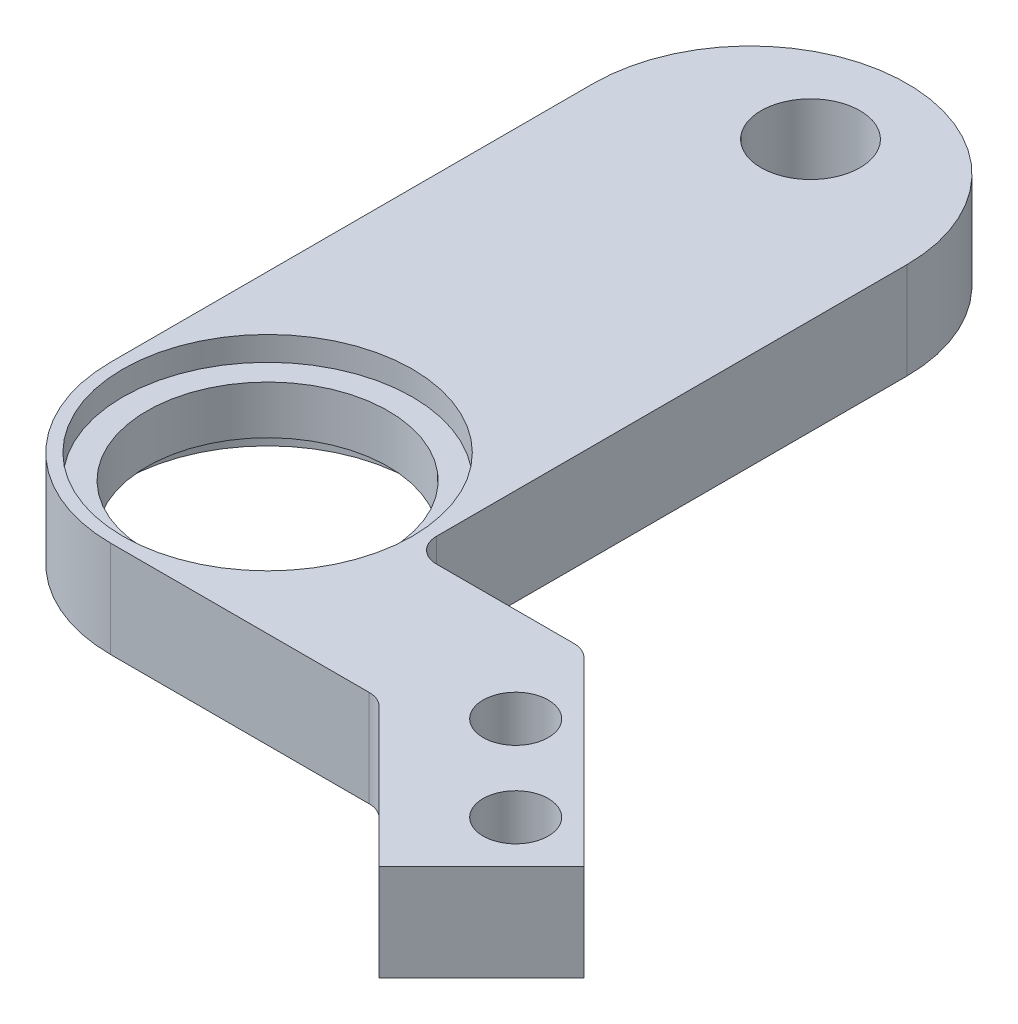
ISO-10303-21;
HEADER;
FILE_DESCRIPTION(('STEP AP214'),'2;1');
FILE_NAME('part.step','',(''),(''),'','','');
FILE_SCHEMA(('AUTOMOTIVE_DESIGN { 1 0 10303 214 1 1 1 1 }'));
ENDSEC;
DATA;
#1=APPLICATION_CONTEXT('core data for automotive mechanical design processes');
#2=APPLICATION_PROTOCOL_DEFINITION('international standard','automotive_design',2000,#1);
#3=PRODUCT_CONTEXT('',#1,'mechanical');
#4=PRODUCT('Part','Part','',(#3));
#5=PRODUCT_RELATED_PRODUCT_CATEGORY('part','',(#4));
#6=PRODUCT_DEFINITION_FORMATION('','',#4);
#7=PRODUCT_DEFINITION_CONTEXT('part definition',#1,'design');
#8=PRODUCT_DEFINITION('design','',#6,#7);
#9=PRODUCT_DEFINITION_SHAPE('','',#8);
#10=(LENGTH_UNIT() NAMED_UNIT(*) SI_UNIT(.MILLI.,.METRE.));
#11=(NAMED_UNIT(*) PLANE_ANGLE_UNIT() SI_UNIT($,.RADIAN.));
#12=(NAMED_UNIT(*) SI_UNIT($,.STERADIAN.) SOLID_ANGLE_UNIT());
#13=UNCERTAINTY_MEASURE_WITH_UNIT(LENGTH_MEASURE(1.E-05),#10,'distance_accuracy_value','');
#14=(GEOMETRIC_REPRESENTATION_CONTEXT(3) GLOBAL_UNCERTAINTY_ASSIGNED_CONTEXT((#13)) GLOBAL_UNIT_ASSIGNED_CONTEXT((#10,
#11,#12)) REPRESENTATION_CONTEXT('',''));
#15=CARTESIAN_POINT('',(0.,0.,0.));
#16=DIRECTION('',(0.,0.,1.));
#17=DIRECTION('',(1.,0.,0.));
#18=AXIS2_PLACEMENT_3D('',#15,#16,#17);
#19=CARTESIAN_POINT('',(11.1243194659491,2.,26.5));
#20=DIRECTION('',(-0.707106781125058,0.,0.707106781248037));
#21=DIRECTION('',(0.707106781248037,0.,0.707106781125058));
#22=AXIS2_PLACEMENT_3D('',#19,#20,#21);
#23=PLANE('',#22);
#24=DIRECTION('',(-0.707106781248037,0.,-0.707106781125058));
#25=VECTOR('',#24,1.);
#26=CARTESIAN_POINT('',(-7.68784026672636,2.,7.68784027059639));
#27=LINE('',#26,#25);
#28=CARTESIAN_POINT('',(17.16726189,2.,32.542942423));
#29=VERTEX_POINT('',#28);
#30=CARTESIAN_POINT('',(11.417212684752,2.,26.792893218752));
#31=VERTEX_POINT('',#30);
#32=EDGE_CURVE('E166',#29,#31,#27,.T.);
#33=ORIENTED_EDGE('',*,*,#32,.T.);
#34=DIRECTION('',(0.,-1.,0.));
#35=VECTOR('',#34,1.);
#36=CARTESIAN_POINT('',(11.417212684752,-2.,26.792893218752));
#37=LINE('',#36,#35);
#38=CARTESIAN_POINT('',(11.417212684752,-2.,26.792893218752));
#39=VERTEX_POINT('',#38);
#40=EDGE_CURVE('E188',#31,#39,#37,.T.);
#41=ORIENTED_EDGE('',*,*,#40,.T.);
#42=DIRECTION('',(-0.707106781248037,0.,-0.707106781125058));
#43=VECTOR('',#42,1.);
#44=CARTESIAN_POINT('',(-7.68784026672636,-2.,7.68784027059639));
#45=LINE('',#44,#43);
#46=CARTESIAN_POINT('',(17.16726189,-2.,32.542942423));
#47=VERTEX_POINT('',#46);
#48=EDGE_CURVE('E153',#47,#39,#45,.T.);
#49=ORIENTED_EDGE('',*,*,#48,.F.);
#50=DIRECTION('',(0.,-1.,0.));
#51=VECTOR('',#50,1.);
#52=CARTESIAN_POINT('',(17.16726189,2.,32.542942423));
#53=LINE('',#52,#51);
#54=EDGE_CURVE('E172',#29,#47,#53,.T.);
#55=ORIENTED_EDGE('',*,*,#54,.F.);
#56=EDGE_LOOP('',(#33,#41,#49,#55));
#57=FACE_BOUND('',#56,.T.);
#58=ADVANCED_FACE('F32',(#57),#23,.T.);
#59=CARTESIAN_POINT('',(13.609600839961,2.,36.100603473039));
#60=DIRECTION('',(0.707106781186549,0.,0.707106781186547));
#61=DIRECTION('',(0.707106781186546,0.,-0.707106781186549));
#62=AXIS2_PLACEMENT_3D('',#59,#60,#61);
#63=PLANE('',#62);
#64=DIRECTION('',(-0.707106781186546,0.,0.707106781186548));
#65=VECTOR('',#64,1.);
#66=CARTESIAN_POINT('',(13.609600839961,-2.,36.100603473039));
#67=LINE('',#66,#65);
#68=CARTESIAN_POINT('',(21.409902577,-2.,28.300301736));
#69=VERTEX_POINT('',#68);
#70=EDGE_CURVE('E163',#69,#47,#67,.T.);
#71=ORIENTED_EDGE('',*,*,#70,.F.);
#72=DIRECTION('',(0.,-1.,0.));
#73=VECTOR('',#72,1.);
#74=CARTESIAN_POINT('',(21.409902577,2.,28.300301736));
#75=LINE('',#74,#73);
#76=CARTESIAN_POINT('',(21.409902577,2.,28.300301736));
#77=VERTEX_POINT('',#76);
#78=EDGE_CURVE('E167',#77,#69,#75,.T.);
#79=ORIENTED_EDGE('',*,*,#78,.F.);
#80=DIRECTION('',(-0.707106781186546,0.,0.707106781186548));
#81=VECTOR('',#80,1.);
#82=CARTESIAN_POINT('',(13.609600839961,2.,36.100603473039));
#83=LINE('',#82,#81);
#84=EDGE_CURVE('E134',#77,#29,#83,.T.);
#85=ORIENTED_EDGE('',*,*,#84,.T.);
#86=ORIENTED_EDGE('',*,*,#54,.T.);
#87=EDGE_LOOP('',(#71,#79,#85,#86));
#88=FACE_BOUND('',#87,.T.);
#89=ADVANCED_FACE('F231',(#88),#63,.T.);
#90=CARTESIAN_POINT('',(13.609600839961,2.,20.5));
#91=DIRECTION('',(0.707106781139451,0.,-0.707106781233644));
#92=DIRECTION('',(-0.707106781233644,0.,-0.707106781139451));
#93=AXIS2_PLACEMENT_3D('',#90,#91,#92);
#94=PLANE('',#93);
#95=DIRECTION('',(0.707106781233644,0.,0.707106781139451));
#96=VECTOR('',#95,1.);
#97=CARTESIAN_POINT('',(-3.44519957965949,-2.,3.44519958265138));
#98=LINE('',#97,#96);
#99=CARTESIAN_POINT('',(13.9024940587664,-2.,20.7928932187664));
#100=VERTEX_POINT('',#99);
#101=EDGE_CURVE('E162',#100,#69,#98,.T.);
#102=ORIENTED_EDGE('',*,*,#101,.F.);
#103=DIRECTION('',(0.,-1.,0.));
#104=VECTOR('',#103,1.);
#105=CARTESIAN_POINT('',(13.9024940587664,2.,20.7928932187664));
#106=LINE('',#105,#104);
#107=CARTESIAN_POINT('',(13.9024940587664,2.,20.7928932187664));
#108=VERTEX_POINT('',#107);
#109=EDGE_CURVE('E195',#100,#108,#106,.F.);
#110=ORIENTED_EDGE('',*,*,#109,.T.);
#111=DIRECTION('',(0.707106781233644,0.,0.707106781139451));
#112=VECTOR('',#111,1.);
#113=CARTESIAN_POINT('',(-3.44519957965949,2.,3.44519958265138));
#114=LINE('',#113,#112);
#115=EDGE_CURVE('E147',#108,#77,#114,.T.);
#116=ORIENTED_EDGE('',*,*,#115,.T.);
#117=ORIENTED_EDGE('',*,*,#78,.T.);
#118=EDGE_LOOP('',(#102,#110,#116,#117));
#119=FACE_BOUND('',#118,.T.);
#120=ADVANCED_FACE('F234',(#119),#94,.T.);
#121=CARTESIAN_POINT('',(6.50000000506592,2.,20.5));
#122=DIRECTION('',(0.,0.,-1.));
#123=DIRECTION('',(-1.,0.,0.));
#124=AXIS2_PLACEMENT_3D('',#121,#122,#123);
#125=PLANE('',#124);
#126=DIRECTION('',(1.,0.,0.));
#127=VECTOR('',#126,1.);
#128=CARTESIAN_POINT('',(6.50000000506592,-2.,20.5));
#129=LINE('',#128,#127);
#130=CARTESIAN_POINT('',(7.50000000506592,-2.,20.5));
#131=VERTEX_POINT('',#130);
#132=CARTESIAN_POINT('',(13.1953872776269,-2.,20.5));
#133=VERTEX_POINT('',#132);
#134=EDGE_CURVE('E159',#131,#133,#129,.T.);
#135=ORIENTED_EDGE('',*,*,#134,.F.);
#136=DIRECTION('',(0.,-1.,0.));
#137=VECTOR('',#136,1.);
#138=CARTESIAN_POINT('',(7.50000000506592,2.,20.5));
#139=LINE('',#138,#137);
#140=CARTESIAN_POINT('',(7.50000000506592,2.,20.5));
#141=VERTEX_POINT('',#140);
#142=EDGE_CURVE('E186',#131,#141,#139,.F.);
#143=ORIENTED_EDGE('',*,*,#142,.T.);
#144=DIRECTION('',(1.,0.,0.));
#145=VECTOR('',#144,1.);
#146=CARTESIAN_POINT('',(6.50000000506592,2.,20.5));
#147=LINE('',#146,#145);
#148=CARTESIAN_POINT('',(13.1953872776269,2.,20.5));
#149=VERTEX_POINT('',#148);
#150=EDGE_CURVE('E141',#141,#149,#147,.T.);
#151=ORIENTED_EDGE('',*,*,#150,.T.);
#152=DIRECTION('',(0.,-1.,0.));
#153=VECTOR('',#152,1.);
#154=CARTESIAN_POINT('',(13.1953872776269,2.,20.5));
#155=LINE('',#154,#153);
#156=EDGE_CURVE('E183',#149,#133,#155,.T.);
#157=ORIENTED_EDGE('',*,*,#156,.T.);
#158=EDGE_LOOP('',(#135,#143,#151,#157));
#159=FACE_BOUND('',#158,.T.);
#160=ADVANCED_FACE('F243',(#159),#125,.T.);
#161=CARTESIAN_POINT('',(6.50000000506592,2.,0.));
#162=DIRECTION('',(1.,0.,0.));
#163=DIRECTION('',(0.,0.,-1.));
#164=AXIS2_PLACEMENT_3D('',#161,#162,#163);
#165=PLANE('',#164);
#166=DIRECTION('',(0.,0.,1.));
#167=VECTOR('',#166,1.);
#168=CARTESIAN_POINT('',(6.50000000506592,2.,0.));
#169=LINE('',#168,#167);
#170=CARTESIAN_POINT('',(6.50000000506592,2.,0.));
#171=VERTEX_POINT('',#170);
#172=CARTESIAN_POINT('',(6.50000000506592,2.,19.5));
#173=VERTEX_POINT('',#172);
#174=EDGE_CURVE('E139',#171,#173,#169,.T.);
#175=ORIENTED_EDGE('',*,*,#174,.T.);
#176=DIRECTION('',(0.,-1.,0.));
#177=VECTOR('',#176,1.);
#178=CARTESIAN_POINT('',(6.50000000506592,-2.,19.5));
#179=LINE('',#178,#177);
#180=CARTESIAN_POINT('',(6.50000000506592,-2.,19.5));
#181=VERTEX_POINT('',#180);
#182=EDGE_CURVE('E180',#173,#181,#179,.T.);
#183=ORIENTED_EDGE('',*,*,#182,.T.);
#184=DIRECTION('',(0.,0.,1.));
#185=VECTOR('',#184,1.);
#186=CARTESIAN_POINT('',(6.50000000506592,-2.,0.));
#187=LINE('',#186,#185);
#188=CARTESIAN_POINT('',(6.50000000506592,-2.,0.));
#189=VERTEX_POINT('',#188);
#190=EDGE_CURVE('E156',#189,#181,#187,.T.);
#191=ORIENTED_EDGE('',*,*,#190,.F.);
#192=DIRECTION('',(0.,-1.,0.));
#193=VECTOR('',#192,1.);
#194=CARTESIAN_POINT('',(6.50000000506592,2.,0.));
#195=LINE('',#194,#193);
#196=EDGE_CURVE('E133',#171,#189,#195,.T.);
#197=ORIENTED_EDGE('',*,*,#196,.F.);
#198=EDGE_LOOP('',(#175,#183,#191,#197));
#199=FACE_BOUND('',#198,.T.);
#200=ADVANCED_FACE('F251',(#199),#165,.T.);
#201=CARTESIAN_POINT('',(2.53296168761796E-09,2.,0.));
#202=DIRECTION('',(0.,-1.,0.));
#203=DIRECTION('',(0.,0.,-1.));
#204=AXIS2_PLACEMENT_3D('',#201,#202,#203);
#205=CYLINDRICAL_SURFACE('',#204,6.50000000253296);
#206=CARTESIAN_POINT('',(2.53296168761796E-09,-2.,0.));
#207=DIRECTION('',(0.,-1.,0.));
#208=DIRECTION('',(0.,0.,-1.));
#209=AXIS2_PLACEMENT_3D('',#206,#207,#208);
#210=CIRCLE('',#209,6.50000000253296);
#211=CARTESIAN_POINT('',(-6.5,-2.,0.));
#212=VERTEX_POINT('',#211);
#213=EDGE_CURVE('E132',#212,#189,#210,.T.);
#214=ORIENTED_EDGE('',*,*,#213,.F.);
#215=DIRECTION('',(0.,-1.,0.));
#216=VECTOR('',#215,1.);
#217=CARTESIAN_POINT('',(-6.5,2.,0.));
#218=LINE('',#217,#216);
#219=CARTESIAN_POINT('',(-6.5,2.,0.));
#220=VERTEX_POINT('',#219);
#221=EDGE_CURVE('E120',#220,#212,#218,.T.);
#222=ORIENTED_EDGE('',*,*,#221,.F.);
#223=CARTESIAN_POINT('',(2.53296168761796E-09,2.,0.));
#224=DIRECTION('',(0.,-1.,0.));
#225=DIRECTION('',(0.,0.,-1.));
#226=AXIS2_PLACEMENT_3D('',#223,#224,#225);
#227=CIRCLE('',#226,6.50000000253296);
#228=EDGE_CURVE('E125',#220,#171,#227,.T.);
#229=ORIENTED_EDGE('',*,*,#228,.T.);
#230=ORIENTED_EDGE('',*,*,#196,.T.);
#231=EDGE_LOOP('',(#214,#222,#229,#230));
#232=FACE_BOUND('',#231,.T.);
#233=ADVANCED_FACE('F130',(#232),#205,.T.);
#234=CARTESIAN_POINT('',(-6.5,2.,26.5));
#235=DIRECTION('',(-1.,0.,0.));
#236=DIRECTION('',(0.,0.,1.));
#237=AXIS2_PLACEMENT_3D('',#234,#235,#236);
#238=PLANE('',#237);
#239=DIRECTION('',(0.,0.,-1.));
#240=VECTOR('',#239,1.);
#241=CARTESIAN_POINT('',(-6.5,-2.,26.5));
#242=LINE('',#241,#240);
#243=CARTESIAN_POINT('',(-6.5,-2.,20.));
#244=VERTEX_POINT('',#243);
#245=EDGE_CURVE('E152',#244,#212,#242,.T.);
#246=ORIENTED_EDGE('',*,*,#245,.F.);
#247=DIRECTION('',(0.,-1.,0.));
#248=VECTOR('',#247,1.);
#249=CARTESIAN_POINT('',(-6.5,2.,20.));
#250=LINE('',#249,#248);
#251=CARTESIAN_POINT('',(-6.5,2.,20.));
#252=VERTEX_POINT('',#251);
#253=EDGE_CURVE('E40',#244,#252,#250,.F.);
#254=ORIENTED_EDGE('',*,*,#253,.T.);
#255=DIRECTION('',(0.,0.,-1.));
#256=VECTOR('',#255,1.);
#257=CARTESIAN_POINT('',(-6.5,2.,26.5));
#258=LINE('',#257,#256);
#259=EDGE_CURVE('E117',#252,#220,#258,.T.);
#260=ORIENTED_EDGE('',*,*,#259,.T.);
#261=ORIENTED_EDGE('',*,*,#221,.T.);
#262=EDGE_LOOP('',(#246,#254,#260,#261));
#263=FACE_BOUND('',#262,.T.);
#264=ADVANCED_FACE('F119',(#263),#238,.T.);
#265=CARTESIAN_POINT('',(11.1243194659491,2.,26.5));
#266=DIRECTION('',(0.,0.,1.));
#267=DIRECTION('',(1.,0.,0.));
#268=AXIS2_PLACEMENT_3D('',#265,#266,#267);
#269=PLANE('',#268);
#270=DIRECTION('',(-1.,0.,0.));
#271=VECTOR('',#270,1.);
#272=CARTESIAN_POINT('',(11.1243194659491,2.,26.5));
#273=LINE('',#272,#271);
#274=CARTESIAN_POINT('',(10.7101059036269,2.,26.5));
#275=VERTEX_POINT('',#274);
#276=CARTESIAN_POINT('',(0.,2.,26.5));
#277=VERTEX_POINT('',#276);
#278=EDGE_CURVE('E126',#275,#277,#273,.T.);
#279=ORIENTED_EDGE('',*,*,#278,.T.);
#280=DIRECTION('',(0.,-1.,0.));
#281=VECTOR('',#280,1.);
#282=CARTESIAN_POINT('',(0.,2.,26.5));
#283=LINE('',#282,#281);
#284=CARTESIAN_POINT('',(0.,-2.,26.5));
#285=VERTEX_POINT('',#284);
#286=EDGE_CURVE('E207',#277,#285,#283,.T.);
#287=ORIENTED_EDGE('',*,*,#286,.T.);
#288=DIRECTION('',(-1.,0.,0.));
#289=VECTOR('',#288,1.);
#290=CARTESIAN_POINT('',(11.1243194659491,-2.,26.5));
#291=LINE('',#290,#289);
#292=CARTESIAN_POINT('',(10.7101059036269,-2.,26.5));
#293=VERTEX_POINT('',#292);
#294=EDGE_CURVE('E150',#293,#285,#291,.T.);
#295=ORIENTED_EDGE('',*,*,#294,.F.);
#296=DIRECTION('',(0.,-1.,0.));
#297=VECTOR('',#296,1.);
#298=CARTESIAN_POINT('',(10.7101059036269,2.,26.5));
#299=LINE('',#298,#297);
#300=EDGE_CURVE('E191',#293,#275,#299,.F.);
#301=ORIENTED_EDGE('',*,*,#300,.T.);
#302=EDGE_LOOP('',(#279,#287,#295,#301));
#303=FACE_BOUND('',#302,.T.);
#304=ADVANCED_FACE('F214',(#303),#269,.T.);
#305=CARTESIAN_POINT('',(2.53296168761796E-09,2.,0.));
#306=DIRECTION('',(0.,-1.,0.));
#307=DIRECTION('',(0.,0.,-1.));
#308=AXIS2_PLACEMENT_3D('',#305,#306,#307);
#309=PLANE('',#308);
#310=CARTESIAN_POINT('',(14.692388155,2.,24.41121444));
#311=DIRECTION('',(0.,-1.,0.));
#312=DIRECTION('',(0.,0.,-1.));
#313=AXIS2_PLACEMENT_3D('',#310,#311,#312);
#314=CIRCLE('',#313,1.34999999999998);
#315=CARTESIAN_POINT('',(14.692388155,2.,23.06121444));
#316=VERTEX_POINT('',#315);
#317=EDGE_CURVE('E282',#316,#316,#314,.T.);
#318=ORIENTED_EDGE('',*,*,#317,.T.);
#319=EDGE_LOOP('',(#318));
#320=FACE_BOUND('',#319,.T.);
#321=CARTESIAN_POINT('',(18.227922061,2.,27.946748346));
#322=DIRECTION('',(0.,-1.,0.));
#323=DIRECTION('',(0.,0.,-1.));
#324=AXIS2_PLACEMENT_3D('',#321,#322,#323);
#325=CIRCLE('',#324,1.34999999999998);
#326=CARTESIAN_POINT('',(18.227922061,2.,26.596748346));
#327=VERTEX_POINT('',#326);
#328=EDGE_CURVE('E276',#327,#327,#325,.T.);
#329=ORIENTED_EDGE('',*,*,#328,.T.);
#330=EDGE_LOOP('',(#329));
#331=FACE_BOUND('',#330,.T.);
#332=CARTESIAN_POINT('',(0.,2.,-2.5));
#333=DIRECTION('',(0.,1.,0.));
#334=DIRECTION('',(0.,0.,1.));
#335=AXIS2_PLACEMENT_3D('',#332,#333,#334);
#336=CIRCLE('',#335,2.04999999999999);
#337=CARTESIAN_POINT('',(0.,2.,-0.450000000000012));
#338=VERTEX_POINT('',#337);
#339=EDGE_CURVE('E273',#338,#338,#336,.T.);
#340=ORIENTED_EDGE('',*,*,#339,.F.);
#341=EDGE_LOOP('',(#340));
#342=FACE_BOUND('',#341,.T.);
#343=CARTESIAN_POINT('',(0.,2.,20.));
#344=DIRECTION('',(0.,-1.,0.));
#345=DIRECTION('',(1.,0.,0.));
#346=AXIS2_PLACEMENT_3D('',#343,#344,#345);
#347=CIRCLE('',#346,6.);
#348=CARTESIAN_POINT('',(6.,2.,20.));
#349=VERTEX_POINT('',#348);
#350=EDGE_CURVE('E176',#349,#349,#347,.T.);
#351=ORIENTED_EDGE('',*,*,#350,.T.);
#352=EDGE_LOOP('',(#351));
#353=FACE_BOUND('',#352,.T.);
#354=ORIENTED_EDGE('',*,*,#259,.F.);
#355=CARTESIAN_POINT('',(0.,2.,20.));
#356=DIRECTION('',(0.,-1.,0.));
#357=DIRECTION('',(0.,0.,-1.));
#358=AXIS2_PLACEMENT_3D('',#355,#356,#357);
#359=CIRCLE('',#358,6.5);
#360=EDGE_CURVE('E11',#252,#277,#359,.F.);
#361=ORIENTED_EDGE('',*,*,#360,.T.);
#362=ORIENTED_EDGE('',*,*,#278,.F.);
#363=CARTESIAN_POINT('',(10.7101059036269,2.,27.5));
#364=DIRECTION('',(0.,-1.,0.));
#365=DIRECTION('',(0.,0.,-1.));
#366=AXIS2_PLACEMENT_3D('',#363,#364,#365);
#367=CIRCLE('',#366,0.999999999999998);
#368=EDGE_CURVE('E205',#275,#31,#367,.T.);
#369=ORIENTED_EDGE('',*,*,#368,.T.);
#370=ORIENTED_EDGE('',*,*,#32,.F.);
#371=ORIENTED_EDGE('',*,*,#84,.F.);
#372=ORIENTED_EDGE('',*,*,#115,.F.);
#373=CARTESIAN_POINT('',(13.1953872776269,2.,21.5));
#374=DIRECTION('',(0.,-1.,0.));
#375=DIRECTION('',(0.,0.,-1.));
#376=AXIS2_PLACEMENT_3D('',#373,#374,#375);
#377=CIRCLE('',#376,0.999999999999998);
#378=EDGE_CURVE('E197',#108,#149,#377,.F.);
#379=ORIENTED_EDGE('',*,*,#378,.T.);
#380=ORIENTED_EDGE('',*,*,#150,.F.);
#381=CARTESIAN_POINT('',(7.50000000506592,2.,19.5));
#382=DIRECTION('',(0.,-1.,0.));
#383=DIRECTION('',(0.,0.,-1.));
#384=AXIS2_PLACEMENT_3D('',#381,#382,#383);
#385=CIRCLE('',#384,0.999999999999998);
#386=EDGE_CURVE('E201',#141,#173,#385,.T.);
#387=ORIENTED_EDGE('',*,*,#386,.T.);
#388=ORIENTED_EDGE('',*,*,#174,.F.);
#389=ORIENTED_EDGE('',*,*,#228,.F.);
#390=EDGE_LOOP('',(#354,#361,#362,#369,#370,#371,#372,#379,#380,#387,#388,#389));
#391=FACE_BOUND('',#390,.T.);
#392=ADVANCED_FACE('F137',(#320,#331,#342,#353,#391),#309,.F.);
#393=CARTESIAN_POINT('',(2.53296168761796E-09,-2.,0.));
#394=DIRECTION('',(0.,-1.,0.));
#395=DIRECTION('',(0.,0.,-1.));
#396=AXIS2_PLACEMENT_3D('',#393,#394,#395);
#397=PLANE('',#396);
#398=CARTESIAN_POINT('',(14.692388155,-2.,24.41121444));
#399=DIRECTION('',(0.,-1.,0.));
#400=DIRECTION('',(0.,0.,-1.));
#401=AXIS2_PLACEMENT_3D('',#398,#399,#400);
#402=CIRCLE('',#401,1.34999999999998);
#403=CARTESIAN_POINT('',(14.692388155,-2.,23.06121444));
#404=VERTEX_POINT('',#403);
#405=EDGE_CURVE('E285',#404,#404,#402,.T.);
#406=ORIENTED_EDGE('',*,*,#405,.F.);
#407=EDGE_LOOP('',(#406));
#408=FACE_BOUND('',#407,.T.);
#409=CARTESIAN_POINT('',(18.227922061,-2.,27.946748346));
#410=DIRECTION('',(0.,-1.,0.));
#411=DIRECTION('',(0.,0.,-1.));
#412=AXIS2_PLACEMENT_3D('',#409,#410,#411);
#413=CIRCLE('',#412,1.34999999999999);
#414=CARTESIAN_POINT('',(18.227922061,-2.,26.596748346));
#415=VERTEX_POINT('',#414);
#416=EDGE_CURVE('E279',#415,#415,#413,.T.);
#417=ORIENTED_EDGE('',*,*,#416,.F.);
#418=EDGE_LOOP('',(#417));
#419=FACE_BOUND('',#418,.T.);
#420=CARTESIAN_POINT('',(0.,-2.,-2.5));
#421=DIRECTION('',(0.,1.,0.));
#422=DIRECTION('',(0.,0.,1.));
#423=AXIS2_PLACEMENT_3D('',#420,#421,#422);
#424=CIRCLE('',#423,2.04999999999999);
#425=CARTESIAN_POINT('',(0.,-2.,-0.450000000000012));
#426=VERTEX_POINT('',#425);
#427=EDGE_CURVE('E270',#426,#426,#424,.T.);
#428=ORIENTED_EDGE('',*,*,#427,.T.);
#429=EDGE_LOOP('',(#428));
#430=FACE_BOUND('',#429,.T.);
#431=CARTESIAN_POINT('',(0.,-2.,20.));
#432=DIRECTION('',(0.,-1.,0.));
#433=DIRECTION('',(1.,0.,0.));
#434=AXIS2_PLACEMENT_3D('',#431,#432,#433);
#435=CIRCLE('',#434,6.);
#436=CARTESIAN_POINT('',(6.,-2.,20.));
#437=VERTEX_POINT('',#436);
#438=EDGE_CURVE('E255',#437,#437,#435,.T.);
#439=ORIENTED_EDGE('',*,*,#438,.F.);
#440=EDGE_LOOP('',(#439));
#441=FACE_BOUND('',#440,.T.);
#442=ORIENTED_EDGE('',*,*,#294,.T.);
#443=CARTESIAN_POINT('',(0.,-2.,20.));
#444=DIRECTION('',(0.,-1.,0.));
#445=DIRECTION('',(0.,0.,-1.));
#446=AXIS2_PLACEMENT_3D('',#443,#444,#445);
#447=CIRCLE('',#446,6.5);
#448=EDGE_CURVE('E54',#285,#244,#447,.T.);
#449=ORIENTED_EDGE('',*,*,#448,.T.);
#450=ORIENTED_EDGE('',*,*,#245,.T.);
#451=ORIENTED_EDGE('',*,*,#213,.T.);
#452=ORIENTED_EDGE('',*,*,#190,.T.);
#453=CARTESIAN_POINT('',(7.50000000506592,-2.,19.5));
#454=DIRECTION('',(0.,-1.,0.));
#455=DIRECTION('',(0.,0.,-1.));
#456=AXIS2_PLACEMENT_3D('',#453,#454,#455);
#457=CIRCLE('',#456,0.999999999999998);
#458=EDGE_CURVE('E199',#181,#131,#457,.F.);
#459=ORIENTED_EDGE('',*,*,#458,.T.);
#460=ORIENTED_EDGE('',*,*,#134,.T.);
#461=CARTESIAN_POINT('',(13.1953872776269,-2.,21.5));
#462=DIRECTION('',(0.,-1.,0.));
#463=DIRECTION('',(0.,0.,-1.));
#464=AXIS2_PLACEMENT_3D('',#461,#462,#463);
#465=CIRCLE('',#464,0.999999999999998);
#466=EDGE_CURVE('E193',#133,#100,#465,.T.);
#467=ORIENTED_EDGE('',*,*,#466,.T.);
#468=ORIENTED_EDGE('',*,*,#101,.T.);
#469=ORIENTED_EDGE('',*,*,#70,.T.);
#470=ORIENTED_EDGE('',*,*,#48,.T.);
#471=CARTESIAN_POINT('',(10.7101059036269,-2.,27.5));
#472=DIRECTION('',(0.,-1.,0.));
#473=DIRECTION('',(0.,0.,-1.));
#474=AXIS2_PLACEMENT_3D('',#471,#472,#473);
#475=CIRCLE('',#474,0.999999999999998);
#476=EDGE_CURVE('E203',#39,#293,#475,.F.);
#477=ORIENTED_EDGE('',*,*,#476,.T.);
#478=EDGE_LOOP('',(#442,#449,#450,#451,#452,#459,#460,#467,#468,#469,#470,#477));
#479=FACE_BOUND('',#478,.T.);
#480=ADVANCED_FACE('F218',(#408,#419,#430,#441,#479),#397,.T.);
#481=CARTESIAN_POINT('',(0.,2.,20.));
#482=DIRECTION('',(0.,-1.,0.));
#483=DIRECTION('',(1.,0.,0.));
#484=AXIS2_PLACEMENT_3D('',#481,#482,#483);
#485=CYLINDRICAL_SURFACE('',#484,6.);
#486=ORIENTED_EDGE('',*,*,#350,.F.);
#487=EDGE_LOOP('',(#486));
#488=FACE_BOUND('',#487,.T.);
#489=CARTESIAN_POINT('',(0.,0.999999999999999,20.));
#490=DIRECTION('',(0.,-1.,0.));
#491=DIRECTION('',(1.,0.,0.));
#492=AXIS2_PLACEMENT_3D('',#489,#490,#491);
#493=CIRCLE('',#492,6.);
#494=CARTESIAN_POINT('',(6.,1.,20.));
#495=VERTEX_POINT('',#494);
#496=EDGE_CURVE('E267',#495,#495,#493,.T.);
#497=ORIENTED_EDGE('',*,*,#496,.T.);
#498=EDGE_LOOP('',(#497));
#499=FACE_BOUND('',#498,.T.);
#500=ADVANCED_FACE('F293',(#488,#499),#485,.F.);
#501=CARTESIAN_POINT('',(0.,2.,20.));
#502=DIRECTION('',(0.,-1.,0.));
#503=DIRECTION('',(1.,0.,0.));
#504=AXIS2_PLACEMENT_3D('',#501,#502,#503);
#505=CYLINDRICAL_SURFACE('',#504,6.);
#506=CARTESIAN_POINT('',(0.,-1.,20.));
#507=DIRECTION('',(0.,-1.,0.));
#508=DIRECTION('',(1.,0.,0.));
#509=AXIS2_PLACEMENT_3D('',#506,#507,#508);
#510=CIRCLE('',#509,6.);
#511=CARTESIAN_POINT('',(6.,-1.,20.));
#512=VERTEX_POINT('',#511);
#513=EDGE_CURVE('E258',#512,#512,#510,.T.);
#514=ORIENTED_EDGE('',*,*,#513,.F.);
#515=EDGE_LOOP('',(#514));
#516=FACE_BOUND('',#515,.T.);
#517=ORIENTED_EDGE('',*,*,#438,.T.);
#518=EDGE_LOOP('',(#517));
#519=FACE_BOUND('',#518,.T.);
#520=ADVANCED_FACE('F301',(#516,#519),#505,.F.);
#521=CARTESIAN_POINT('',(6.,-1.,20.));
#522=DIRECTION('',(0.,1.,0.));
#523=DIRECTION('',(-1.,0.,0.));
#524=AXIS2_PLACEMENT_3D('',#521,#522,#523);
#525=PLANE('',#524);
#526=CARTESIAN_POINT('',(0.,-1.,20.));
#527=DIRECTION('',(0.,-1.,0.));
#528=DIRECTION('',(1.,0.,0.));
#529=AXIS2_PLACEMENT_3D('',#526,#527,#528);
#530=CIRCLE('',#529,5.);
#531=CARTESIAN_POINT('',(5.,-1.,20.));
#532=VERTEX_POINT('',#531);
#533=EDGE_CURVE('E261',#532,#532,#530,.T.);
#534=ORIENTED_EDGE('',*,*,#533,.F.);
#535=EDGE_LOOP('',(#534));
#536=FACE_BOUND('',#535,.T.);
#537=ORIENTED_EDGE('',*,*,#513,.T.);
#538=EDGE_LOOP('',(#537));
#539=FACE_BOUND('',#538,.T.);
#540=ADVANCED_FACE('F303',(#536,#539),#525,.F.);
#541=CARTESIAN_POINT('',(0.,2.,20.));
#542=DIRECTION('',(0.,-1.,0.));
#543=DIRECTION('',(1.,0.,0.));
#544=AXIS2_PLACEMENT_3D('',#541,#542,#543);
#545=CYLINDRICAL_SURFACE('',#544,5.);
#546=CARTESIAN_POINT('',(0.,0.999999999999999,20.));
#547=DIRECTION('',(0.,-1.,0.));
#548=DIRECTION('',(1.,0.,0.));
#549=AXIS2_PLACEMENT_3D('',#546,#547,#548);
#550=CIRCLE('',#549,5.);
#551=CARTESIAN_POINT('',(5.,1.,20.));
#552=VERTEX_POINT('',#551);
#553=EDGE_CURVE('E264',#552,#552,#550,.T.);
#554=ORIENTED_EDGE('',*,*,#553,.F.);
#555=EDGE_LOOP('',(#554));
#556=FACE_BOUND('',#555,.T.);
#557=ORIENTED_EDGE('',*,*,#533,.T.);
#558=EDGE_LOOP('',(#557));
#559=FACE_BOUND('',#558,.T.);
#560=ADVANCED_FACE('F310',(#556,#559),#545,.F.);
#561=CARTESIAN_POINT('',(5.,1.,20.));
#562=DIRECTION('',(0.,-1.,0.));
#563=DIRECTION('',(1.,0.,0.));
#564=AXIS2_PLACEMENT_3D('',#561,#562,#563);
#565=PLANE('',#564);
#566=ORIENTED_EDGE('',*,*,#496,.F.);
#567=EDGE_LOOP('',(#566));
#568=FACE_BOUND('',#567,.T.);
#569=ORIENTED_EDGE('',*,*,#553,.T.);
#570=EDGE_LOOP('',(#569));
#571=FACE_BOUND('',#570,.T.);
#572=ADVANCED_FACE('F440',(#568,#571),#565,.F.);
#573=CARTESIAN_POINT('',(0.,2.,-2.5));
#574=DIRECTION('',(0.,1.,0.));
#575=DIRECTION('',(0.,0.,1.));
#576=AXIS2_PLACEMENT_3D('',#573,#574,#575);
#577=CYLINDRICAL_SURFACE('',#576,2.04999999999999);
#578=ORIENTED_EDGE('',*,*,#427,.F.);
#579=EDGE_LOOP('',(#578));
#580=FACE_BOUND('',#579,.T.);
#581=ORIENTED_EDGE('',*,*,#339,.T.);
#582=EDGE_LOOP('',(#581));
#583=FACE_BOUND('',#582,.T.);
#584=ADVANCED_FACE('F430',(#580,#583),#577,.F.);
#585=CARTESIAN_POINT('',(18.227922061,-2.,27.946748346));
#586=DIRECTION('',(0.,-1.,0.));
#587=DIRECTION('',(0.,0.,-1.));
#588=AXIS2_PLACEMENT_3D('',#585,#586,#587);
#589=CYLINDRICAL_SURFACE('',#588,1.34999999999998);
#590=ORIENTED_EDGE('',*,*,#328,.F.);
#591=EDGE_LOOP('',(#590));
#592=FACE_BOUND('',#591,.T.);
#593=ORIENTED_EDGE('',*,*,#416,.T.);
#594=EDGE_LOOP('',(#593));
#595=FACE_BOUND('',#594,.T.);
#596=ADVANCED_FACE('F420',(#592,#595),#589,.F.);
#597=CARTESIAN_POINT('',(14.692388155,-2.,24.41121444));
#598=DIRECTION('',(0.,-1.,0.));
#599=DIRECTION('',(0.,0.,-1.));
#600=AXIS2_PLACEMENT_3D('',#597,#598,#599);
#601=CYLINDRICAL_SURFACE('',#600,1.34999999999998);
#602=ORIENTED_EDGE('',*,*,#317,.F.);
#603=EDGE_LOOP('',(#602));
#604=FACE_BOUND('',#603,.T.);
#605=ORIENTED_EDGE('',*,*,#405,.T.);
#606=EDGE_LOOP('',(#605));
#607=FACE_BOUND('',#606,.T.);
#608=ADVANCED_FACE('F289',(#604,#607),#601,.F.);
#609=CARTESIAN_POINT('',(7.50000000506592,2.,19.5));
#610=DIRECTION('',(0.,1.,0.));
#611=DIRECTION('',(0.,0.,1.));
#612=AXIS2_PLACEMENT_3D('',#609,#610,#611);
#613=CYLINDRICAL_SURFACE('',#612,0.999999999999998);
#614=ORIENTED_EDGE('',*,*,#386,.F.);
#615=ORIENTED_EDGE('',*,*,#142,.F.);
#616=ORIENTED_EDGE('',*,*,#458,.F.);
#617=ORIENTED_EDGE('',*,*,#182,.F.);
#618=EDGE_LOOP('',(#614,#615,#616,#617));
#619=FACE_BOUND('',#618,.T.);
#620=ADVANCED_FACE('F249',(#619),#613,.F.);
#621=CARTESIAN_POINT('',(10.7101059036269,2.,27.5));
#622=DIRECTION('',(0.,1.,0.));
#623=DIRECTION('',(0.,0.,1.));
#624=AXIS2_PLACEMENT_3D('',#621,#622,#623);
#625=CYLINDRICAL_SURFACE('',#624,0.999999999999998);
#626=ORIENTED_EDGE('',*,*,#368,.F.);
#627=ORIENTED_EDGE('',*,*,#300,.F.);
#628=ORIENTED_EDGE('',*,*,#476,.F.);
#629=ORIENTED_EDGE('',*,*,#40,.F.);
#630=EDGE_LOOP('',(#626,#627,#628,#629));
#631=FACE_BOUND('',#630,.T.);
#632=ADVANCED_FACE('F223',(#631),#625,.F.);
#633=CARTESIAN_POINT('',(13.1953872776269,2.,21.5));
#634=DIRECTION('',(0.,-1.,0.));
#635=DIRECTION('',(0.,0.,-1.));
#636=AXIS2_PLACEMENT_3D('',#633,#634,#635);
#637=CYLINDRICAL_SURFACE('',#636,0.999999999999998);
#638=ORIENTED_EDGE('',*,*,#378,.F.);
#639=ORIENTED_EDGE('',*,*,#109,.F.);
#640=ORIENTED_EDGE('',*,*,#466,.F.);
#641=ORIENTED_EDGE('',*,*,#156,.F.);
#642=EDGE_LOOP('',(#638,#639,#640,#641));
#643=FACE_BOUND('',#642,.T.);
#644=ADVANCED_FACE('F240',(#643),#637,.T.);
#645=CARTESIAN_POINT('',(0.,2.,20.));
#646=DIRECTION('',(0.,-1.,0.));
#647=DIRECTION('',(0.,0.,-1.));
#648=AXIS2_PLACEMENT_3D('',#645,#646,#647);
#649=CYLINDRICAL_SURFACE('',#648,6.5);
#650=ORIENTED_EDGE('',*,*,#360,.F.);
#651=ORIENTED_EDGE('',*,*,#253,.F.);
#652=ORIENTED_EDGE('',*,*,#448,.F.);
#653=ORIENTED_EDGE('',*,*,#286,.F.);
#654=EDGE_LOOP('',(#650,#651,#652,#653));
#655=FACE_BOUND('',#654,.T.);
#656=ADVANCED_FACE('F34',(#655),#649,.T.);
#657=CLOSED_SHELL('',(#58,#89,#120,#160,#200,#233,#264,#304,#392,#480,#500,#520,#540,#560,#572,
#584,#596,#608,#620,#632,#644,#656));
#658=MANIFOLD_SOLID_BREP('B2',#657);
#659=ADVANCED_BREP_SHAPE_REPRESENTATION('',(#18,#658),#14);
#660=SHAPE_DEFINITION_REPRESENTATION(#9,#659);
ENDSEC;
END-ISO-10303-21;
